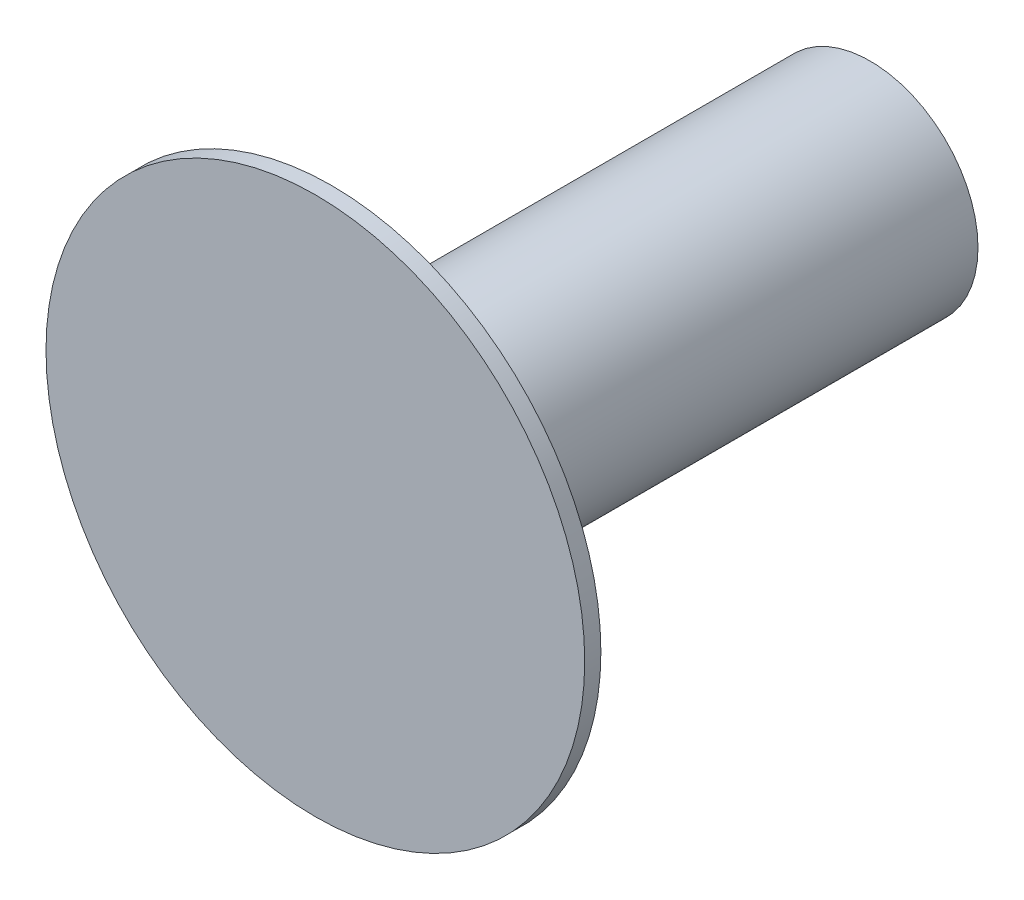
ISO-10303-21;
HEADER;
FILE_DESCRIPTION(('STEP AP214'),'2;1');
FILE_NAME('part.step','',(''),(''),'','','');
FILE_SCHEMA(('AUTOMOTIVE_DESIGN { 1 0 10303 214 1 1 1 1 }'));
ENDSEC;
DATA;
#1=APPLICATION_CONTEXT('core data for automotive mechanical design processes');
#2=APPLICATION_PROTOCOL_DEFINITION('international standard','automotive_design',2000,#1);
#3=PRODUCT_CONTEXT('',#1,'mechanical');
#4=PRODUCT('Part','Part','',(#3));
#5=PRODUCT_RELATED_PRODUCT_CATEGORY('part','',(#4));
#6=PRODUCT_DEFINITION_FORMATION('','',#4);
#7=PRODUCT_DEFINITION_CONTEXT('part definition',#1,'design');
#8=PRODUCT_DEFINITION('design','',#6,#7);
#9=PRODUCT_DEFINITION_SHAPE('','',#8);
#10=(LENGTH_UNIT() NAMED_UNIT(*) SI_UNIT(.MILLI.,.METRE.));
#11=(NAMED_UNIT(*) PLANE_ANGLE_UNIT() SI_UNIT($,.RADIAN.));
#12=(NAMED_UNIT(*) SI_UNIT($,.STERADIAN.) SOLID_ANGLE_UNIT());
#13=UNCERTAINTY_MEASURE_WITH_UNIT(LENGTH_MEASURE(1.E-05),#10,'distance_accuracy_value','');
#14=(GEOMETRIC_REPRESENTATION_CONTEXT(3) GLOBAL_UNCERTAINTY_ASSIGNED_CONTEXT((#13)) GLOBAL_UNIT_ASSIGNED_CONTEXT((#10,
#11,#12)) REPRESENTATION_CONTEXT('',''));
#15=CARTESIAN_POINT('',(0.,0.,0.));
#16=DIRECTION('',(0.,0.,1.));
#17=DIRECTION('',(1.,0.,0.));
#18=AXIS2_PLACEMENT_3D('',#15,#16,#17);
#19=CARTESIAN_POINT('',(0.,0.,0.6));
#20=DIRECTION('',(0.,0.,-1.));
#21=DIRECTION('',(-1.,0.,0.));
#22=AXIS2_PLACEMENT_3D('',#19,#20,#21);
#23=CYLINDRICAL_SURFACE('',#22,9.99999999999999);
#24=CARTESIAN_POINT('',(0.,0.,0.6));
#25=DIRECTION('',(0.,0.,1.));
#26=DIRECTION('',(1.,0.,0.));
#27=AXIS2_PLACEMENT_3D('',#24,#25,#26);
#28=CIRCLE('',#27,9.99999999999999);
#29=CARTESIAN_POINT('',(9.99999999999999,0.,0.6));
#30=VERTEX_POINT('',#29);
#31=EDGE_CURVE('E40',#30,#30,#28,.T.);
#32=ORIENTED_EDGE('',*,*,#31,.F.);
#33=EDGE_LOOP('',(#32));
#34=FACE_BOUND('',#33,.T.);
#35=CARTESIAN_POINT('',(0.,0.,0.));
#36=DIRECTION('',(0.,0.,1.));
#37=DIRECTION('',(1.,0.,0.));
#38=AXIS2_PLACEMENT_3D('',#35,#36,#37);
#39=CIRCLE('',#38,9.99999999999999);
#40=CARTESIAN_POINT('',(9.99999999999999,0.,0.));
#41=VERTEX_POINT('',#40);
#42=EDGE_CURVE('E36',#41,#41,#39,.T.);
#43=ORIENTED_EDGE('',*,*,#42,.T.);
#44=EDGE_LOOP('',(#43));
#45=FACE_BOUND('',#44,.T.);
#46=ADVANCED_FACE('F33',(#34,#45),#23,.T.);
#47=CARTESIAN_POINT('',(0.,0.,0.6));
#48=DIRECTION('',(0.,0.,1.));
#49=DIRECTION('',(1.,0.,0.));
#50=AXIS2_PLACEMENT_3D('',#47,#48,#49);
#51=PLANE('',#50);
#52=ORIENTED_EDGE('',*,*,#31,.T.);
#53=EDGE_LOOP('',(#52));
#54=FACE_BOUND('',#53,.T.);
#55=ADVANCED_FACE('F57',(#54),#51,.T.);
#56=CARTESIAN_POINT('',(0.,0.,0.));
#57=DIRECTION('',(0.,0.,1.));
#58=DIRECTION('',(1.,0.,0.));
#59=AXIS2_PLACEMENT_3D('',#56,#57,#58);
#60=PLANE('',#59);
#61=CARTESIAN_POINT('',(0.,0.,0.));
#62=DIRECTION('',(0.,0.,-1.));
#63=DIRECTION('',(-1.,0.,0.));
#64=AXIS2_PLACEMENT_3D('',#61,#62,#63);
#65=CIRCLE('',#64,4.);
#66=CARTESIAN_POINT('',(-4.,0.,0.));
#67=VERTEX_POINT('',#66);
#68=EDGE_CURVE('E10',#67,#67,#65,.T.);
#69=ORIENTED_EDGE('',*,*,#68,.F.);
#70=EDGE_LOOP('',(#69));
#71=FACE_BOUND('',#70,.T.);
#72=ORIENTED_EDGE('',*,*,#42,.F.);
#73=EDGE_LOOP('',(#72));
#74=FACE_BOUND('',#73,.T.);
#75=ADVANCED_FACE('F54',(#71,#74),#60,.F.);
#76=CARTESIAN_POINT('',(0.,0.,-20.));
#77=DIRECTION('',(0.,0.,1.));
#78=DIRECTION('',(1.,0.,0.));
#79=AXIS2_PLACEMENT_3D('',#76,#77,#78);
#80=CYLINDRICAL_SURFACE('',#79,4.);
#81=CARTESIAN_POINT('',(0.,0.,-20.));
#82=DIRECTION('',(0.,0.,-1.));
#83=DIRECTION('',(-1.,0.,0.));
#84=AXIS2_PLACEMENT_3D('',#81,#82,#83);
#85=CIRCLE('',#84,4.);
#86=CARTESIAN_POINT('',(-4.,0.,-20.));
#87=VERTEX_POINT('',#86);
#88=EDGE_CURVE('E46',#87,#87,#85,.T.);
#89=ORIENTED_EDGE('',*,*,#88,.F.);
#90=EDGE_LOOP('',(#89));
#91=FACE_BOUND('',#90,.T.);
#92=ORIENTED_EDGE('',*,*,#68,.T.);
#93=EDGE_LOOP('',(#92));
#94=FACE_BOUND('',#93,.T.);
#95=ADVANCED_FACE('F56',(#91,#94),#80,.T.);
#96=CARTESIAN_POINT('',(0.,0.,-20.));
#97=DIRECTION('',(0.,0.,-1.));
#98=DIRECTION('',(-1.,0.,0.));
#99=AXIS2_PLACEMENT_3D('',#96,#97,#98);
#100=PLANE('',#99);
#101=ORIENTED_EDGE('',*,*,#88,.T.);
#102=EDGE_LOOP('',(#101));
#103=FACE_BOUND('',#102,.T.);
#104=ADVANCED_FACE('F64',(#103),#100,.T.);
#105=CLOSED_SHELL('',(#46,#55,#75,#95,#104));
#106=MANIFOLD_SOLID_BREP('B2',#105);
#107=ADVANCED_BREP_SHAPE_REPRESENTATION('',(#18,#106),#14);
#108=SHAPE_DEFINITION_REPRESENTATION(#9,#107);
ENDSEC;
END-ISO-10303-21;
